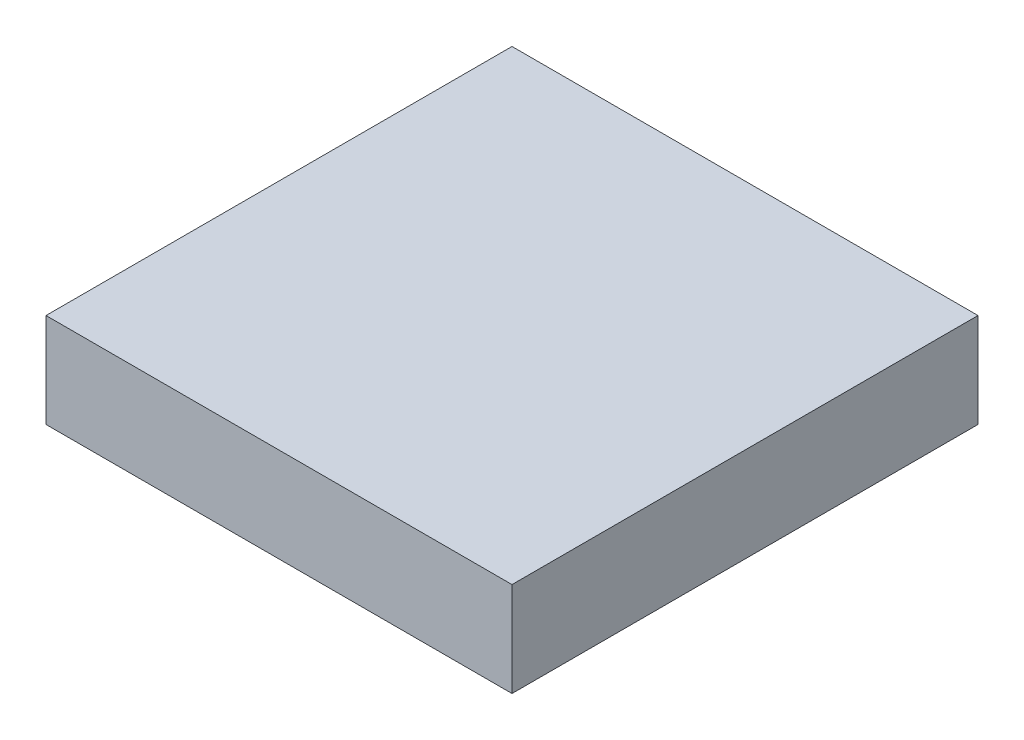
ISO-10303-21;
HEADER;
FILE_DESCRIPTION(('STEP AP214'),'2;1');
FILE_NAME('part.step','',(''),(''),'','','');
FILE_SCHEMA(('AUTOMOTIVE_DESIGN { 1 0 10303 214 1 1 1 1 }'));
ENDSEC;
DATA;
#1=APPLICATION_CONTEXT('core data for automotive mechanical design processes');
#2=APPLICATION_PROTOCOL_DEFINITION('international standard','automotive_design',2000,#1);
#3=PRODUCT_CONTEXT('',#1,'mechanical');
#4=PRODUCT('Part','Part','',(#3));
#5=PRODUCT_RELATED_PRODUCT_CATEGORY('part','',(#4));
#6=PRODUCT_DEFINITION_FORMATION('','',#4);
#7=PRODUCT_DEFINITION_CONTEXT('part definition',#1,'design');
#8=PRODUCT_DEFINITION('design','',#6,#7);
#9=PRODUCT_DEFINITION_SHAPE('','',#8);
#10=(LENGTH_UNIT() NAMED_UNIT(*) SI_UNIT(.MILLI.,.METRE.));
#11=(NAMED_UNIT(*) PLANE_ANGLE_UNIT() SI_UNIT($,.RADIAN.));
#12=(NAMED_UNIT(*) SI_UNIT($,.STERADIAN.) SOLID_ANGLE_UNIT());
#13=UNCERTAINTY_MEASURE_WITH_UNIT(LENGTH_MEASURE(1.E-05),#10,'distance_accuracy_value','');
#14=(GEOMETRIC_REPRESENTATION_CONTEXT(3) GLOBAL_UNCERTAINTY_ASSIGNED_CONTEXT((#13)) GLOBAL_UNIT_ASSIGNED_CONTEXT((#10,
#11,#12)) REPRESENTATION_CONTEXT('',''));
#15=CARTESIAN_POINT('',(0.,0.,0.));
#16=DIRECTION('',(0.,0.,1.));
#17=DIRECTION('',(1.,0.,0.));
#18=AXIS2_PLACEMENT_3D('',#15,#16,#17);
#19=CARTESIAN_POINT('',(-7.9,3.2,-7.9));
#20=DIRECTION('',(1.,0.,0.));
#21=DIRECTION('',(0.,0.,-1.));
#22=AXIS2_PLACEMENT_3D('',#19,#20,#21);
#23=PLANE('',#22);
#24=DIRECTION('',(0.,0.,1.));
#25=VECTOR('',#24,1.);
#26=CARTESIAN_POINT('',(-7.9,0.,-7.9));
#27=LINE('',#26,#25);
#28=CARTESIAN_POINT('',(-7.9,0.,-7.9));
#29=VERTEX_POINT('',#28);
#30=CARTESIAN_POINT('',(-7.9,0.,7.9));
#31=VERTEX_POINT('',#30);
#32=EDGE_CURVE('E166',#29,#31,#27,.T.);
#33=ORIENTED_EDGE('',*,*,#32,.T.);
#34=DIRECTION('',(0.,-1.,0.));
#35=VECTOR('',#34,1.);
#36=CARTESIAN_POINT('',(-7.9,3.2,7.9));
#37=LINE('',#36,#35);
#38=CARTESIAN_POINT('',(-7.9,3.2,7.9));
#39=VERTEX_POINT('',#38);
#40=EDGE_CURVE('E13',#39,#31,#37,.T.);
#41=ORIENTED_EDGE('',*,*,#40,.F.);
#42=DIRECTION('',(0.,0.,1.));
#43=VECTOR('',#42,1.);
#44=CARTESIAN_POINT('',(-7.9,3.2,-7.9));
#45=LINE('',#44,#43);
#46=CARTESIAN_POINT('',(-7.9,3.2,-7.9));
#47=VERTEX_POINT('',#46);
#48=EDGE_CURVE('E159',#47,#39,#45,.T.);
#49=ORIENTED_EDGE('',*,*,#48,.F.);
#50=DIRECTION('',(0.,-1.,0.));
#51=VECTOR('',#50,1.);
#52=CARTESIAN_POINT('',(-7.9,3.2,-7.9));
#53=LINE('',#52,#51);
#54=EDGE_CURVE('E165',#47,#29,#53,.T.);
#55=ORIENTED_EDGE('',*,*,#54,.T.);
#56=EDGE_LOOP('',(#33,#41,#49,#55));
#57=FACE_BOUND('',#56,.T.);
#58=ADVANCED_FACE('F50',(#57),#23,.F.);
#59=CARTESIAN_POINT('',(7.9,3.2,7.9));
#60=DIRECTION('',(0.,0.,-1.));
#61=DIRECTION('',(-1.,0.,0.));
#62=AXIS2_PLACEMENT_3D('',#59,#60,#61);
#63=PLANE('',#62);
#64=DIRECTION('',(1.,0.,0.));
#65=VECTOR('',#64,1.);
#66=CARTESIAN_POINT('',(7.9,0.,7.9));
#67=LINE('',#66,#65);
#68=CARTESIAN_POINT('',(7.9,0.,7.9));
#69=VERTEX_POINT('',#68);
#70=EDGE_CURVE('E169',#31,#69,#67,.T.);
#71=ORIENTED_EDGE('',*,*,#70,.T.);
#72=DIRECTION('',(0.,-1.,0.));
#73=VECTOR('',#72,1.);
#74=CARTESIAN_POINT('',(7.9,3.2,7.9));
#75=LINE('',#74,#73);
#76=CARTESIAN_POINT('',(7.9,3.2,7.9));
#77=VERTEX_POINT('',#76);
#78=EDGE_CURVE('E57',#77,#69,#75,.T.);
#79=ORIENTED_EDGE('',*,*,#78,.F.);
#80=DIRECTION('',(1.,0.,0.));
#81=VECTOR('',#80,1.);
#82=CARTESIAN_POINT('',(7.9,3.2,7.9));
#83=LINE('',#82,#81);
#84=EDGE_CURVE('E101',#39,#77,#83,.T.);
#85=ORIENTED_EDGE('',*,*,#84,.F.);
#86=ORIENTED_EDGE('',*,*,#40,.T.);
#87=EDGE_LOOP('',(#71,#79,#85,#86));
#88=FACE_BOUND('',#87,.T.);
#89=ADVANCED_FACE('F197',(#88),#63,.F.);
#90=CARTESIAN_POINT('',(7.9,3.2,-7.9));
#91=DIRECTION('',(-1.,0.,0.));
#92=DIRECTION('',(0.,0.,1.));
#93=AXIS2_PLACEMENT_3D('',#90,#91,#92);
#94=PLANE('',#93);
#95=DIRECTION('',(0.,0.,-1.));
#96=VECTOR('',#95,1.);
#97=CARTESIAN_POINT('',(7.9,0.,-7.9));
#98=LINE('',#97,#96);
#99=CARTESIAN_POINT('',(7.9,0.,-7.9));
#100=VERTEX_POINT('',#99);
#101=EDGE_CURVE('E171',#69,#100,#98,.T.);
#102=ORIENTED_EDGE('',*,*,#101,.T.);
#103=DIRECTION('',(0.,-1.,0.));
#104=VECTOR('',#103,1.);
#105=CARTESIAN_POINT('',(7.9,3.2,-7.9));
#106=LINE('',#105,#104);
#107=CARTESIAN_POINT('',(7.9,3.2,-7.9));
#108=VERTEX_POINT('',#107);
#109=EDGE_CURVE('E175',#108,#100,#106,.T.);
#110=ORIENTED_EDGE('',*,*,#109,.F.);
#111=DIRECTION('',(0.,0.,-1.));
#112=VECTOR('',#111,1.);
#113=CARTESIAN_POINT('',(7.9,3.2,-7.9));
#114=LINE('',#113,#112);
#115=EDGE_CURVE('E162',#77,#108,#114,.T.);
#116=ORIENTED_EDGE('',*,*,#115,.F.);
#117=ORIENTED_EDGE('',*,*,#78,.T.);
#118=EDGE_LOOP('',(#102,#110,#116,#117));
#119=FACE_BOUND('',#118,.T.);
#120=ADVANCED_FACE('F180',(#119),#94,.F.);
#121=CARTESIAN_POINT('',(7.9,3.2,-7.9));
#122=DIRECTION('',(0.,0.,1.));
#123=DIRECTION('',(1.,0.,0.));
#124=AXIS2_PLACEMENT_3D('',#121,#122,#123);
#125=PLANE('',#124);
#126=DIRECTION('',(-1.,0.,0.));
#127=VECTOR('',#126,1.);
#128=CARTESIAN_POINT('',(7.9,0.,-7.9));
#129=LINE('',#128,#127);
#130=EDGE_CURVE('E94',#100,#29,#129,.T.);
#131=ORIENTED_EDGE('',*,*,#130,.T.);
#132=ORIENTED_EDGE('',*,*,#54,.F.);
#133=DIRECTION('',(-1.,0.,0.));
#134=VECTOR('',#133,1.);
#135=CARTESIAN_POINT('',(7.9,3.2,-7.9));
#136=LINE('',#135,#134);
#137=EDGE_CURVE('E73',#108,#47,#136,.T.);
#138=ORIENTED_EDGE('',*,*,#137,.F.);
#139=ORIENTED_EDGE('',*,*,#109,.T.);
#140=EDGE_LOOP('',(#131,#132,#138,#139));
#141=FACE_BOUND('',#140,.T.);
#142=ADVANCED_FACE('F188',(#141),#125,.F.);
#143=CARTESIAN_POINT('',(0.,3.2,0.));
#144=DIRECTION('',(0.,-1.,0.));
#145=DIRECTION('',(0.,0.,-1.));
#146=AXIS2_PLACEMENT_3D('',#143,#144,#145);
#147=PLANE('',#146);
#148=ORIENTED_EDGE('',*,*,#48,.T.);
#149=ORIENTED_EDGE('',*,*,#84,.T.);
#150=ORIENTED_EDGE('',*,*,#115,.T.);
#151=ORIENTED_EDGE('',*,*,#137,.T.);
#152=EDGE_LOOP('',(#148,#149,#150,#151));
#153=FACE_BOUND('',#152,.T.);
#154=ADVANCED_FACE('F190',(#153),#147,.F.);
#155=CARTESIAN_POINT('',(0.,0.,0.));
#156=DIRECTION('',(0.,-1.,0.));
#157=DIRECTION('',(0.,0.,-1.));
#158=AXIS2_PLACEMENT_3D('',#155,#156,#157);
#159=PLANE('',#158);
#160=DIRECTION('',(-1.,0.,0.));
#161=VECTOR('',#160,1.);
#162=CARTESIAN_POINT('',(0.,0.,6.7));
#163=LINE('',#162,#161);
#164=CARTESIAN_POINT('',(6.7,0.,6.7));
#165=VERTEX_POINT('',#164);
#166=CARTESIAN_POINT('',(-6.7,0.,6.7));
#167=VERTEX_POINT('',#166);
#168=EDGE_CURVE('E64',#165,#167,#163,.T.);
#169=ORIENTED_EDGE('',*,*,#168,.F.);
#170=DIRECTION('',(0.,0.,-1.));
#171=VECTOR('',#170,1.);
#172=CARTESIAN_POINT('',(6.7,0.,0.));
#173=LINE('',#172,#171);
#174=CARTESIAN_POINT('',(6.7,0.,-6.7));
#175=VERTEX_POINT('',#174);
#176=EDGE_CURVE('E144',#165,#175,#173,.T.);
#177=ORIENTED_EDGE('',*,*,#176,.T.);
#178=DIRECTION('',(-1.,0.,0.));
#179=VECTOR('',#178,1.);
#180=CARTESIAN_POINT('',(0.,0.,-6.7));
#181=LINE('',#180,#179);
#182=CARTESIAN_POINT('',(-6.7,0.,-6.7));
#183=VERTEX_POINT('',#182);
#184=EDGE_CURVE('E152',#175,#183,#181,.T.);
#185=ORIENTED_EDGE('',*,*,#184,.T.);
#186=DIRECTION('',(0.,0.,-1.));
#187=VECTOR('',#186,1.);
#188=CARTESIAN_POINT('',(-6.7,0.,0.));
#189=LINE('',#188,#187);
#190=EDGE_CURVE('E132',#167,#183,#189,.T.);
#191=ORIENTED_EDGE('',*,*,#190,.F.);
#192=EDGE_LOOP('',(#169,#177,#185,#191));
#193=FACE_BOUND('',#192,.T.);
#194=ORIENTED_EDGE('',*,*,#32,.F.);
#195=ORIENTED_EDGE('',*,*,#130,.F.);
#196=ORIENTED_EDGE('',*,*,#101,.F.);
#197=ORIENTED_EDGE('',*,*,#70,.F.);
#198=EDGE_LOOP('',(#194,#195,#196,#197));
#199=FACE_BOUND('',#198,.T.);
#200=ADVANCED_FACE('F184',(#193,#199),#159,.T.);
#201=CARTESIAN_POINT('',(0.,22.1504617357995,6.7));
#202=DIRECTION('',(0.,0.,1.));
#203=DIRECTION('',(1.,0.,0.));
#204=AXIS2_PLACEMENT_3D('',#201,#202,#203);
#205=PLANE('',#204);
#206=DIRECTION('',(1.,0.,0.));
#207=VECTOR('',#206,1.);
#208=CARTESIAN_POINT('',(0.,2.,6.7));
#209=LINE('',#208,#207);
#210=CARTESIAN_POINT('',(-6.7,2.,6.7));
#211=VERTEX_POINT('',#210);
#212=CARTESIAN_POINT('',(6.7,2.,6.7));
#213=VERTEX_POINT('',#212);
#214=EDGE_CURVE('E122',#211,#213,#209,.T.);
#215=ORIENTED_EDGE('',*,*,#214,.T.);
#216=DIRECTION('',(0.,-1.,0.));
#217=VECTOR('',#216,1.);
#218=CARTESIAN_POINT('',(6.7,22.1504617357995,6.7));
#219=LINE('',#218,#217);
#220=EDGE_CURVE('E126',#213,#165,#219,.T.);
#221=ORIENTED_EDGE('',*,*,#220,.T.);
#222=ORIENTED_EDGE('',*,*,#168,.T.);
#223=DIRECTION('',(0.,-1.,0.));
#224=VECTOR('',#223,1.);
#225=CARTESIAN_POINT('',(-6.7,22.1504617357995,6.7));
#226=LINE('',#225,#224);
#227=EDGE_CURVE('E128',#211,#167,#226,.T.);
#228=ORIENTED_EDGE('',*,*,#227,.F.);
#229=EDGE_LOOP('',(#215,#221,#222,#228));
#230=FACE_BOUND('',#229,.T.);
#231=ADVANCED_FACE('F124',(#230),#205,.F.);
#232=CARTESIAN_POINT('',(6.7,22.1504617357995,0.));
#233=DIRECTION('',(-1.,0.,0.));
#234=DIRECTION('',(0.,0.,1.));
#235=AXIS2_PLACEMENT_3D('',#232,#233,#234);
#236=PLANE('',#235);
#237=DIRECTION('',(0.,-1.,0.));
#238=VECTOR('',#237,1.);
#239=CARTESIAN_POINT('',(6.7,22.1504617357995,-6.7));
#240=LINE('',#239,#238);
#241=CARTESIAN_POINT('',(6.7,2.,-6.7));
#242=VERTEX_POINT('',#241);
#243=EDGE_CURVE('E150',#242,#175,#240,.T.);
#244=ORIENTED_EDGE('',*,*,#243,.T.);
#245=ORIENTED_EDGE('',*,*,#176,.F.);
#246=ORIENTED_EDGE('',*,*,#220,.F.);
#247=DIRECTION('',(0.,0.,1.));
#248=VECTOR('',#247,1.);
#249=CARTESIAN_POINT('',(6.7,2.,0.));
#250=LINE('',#249,#248);
#251=EDGE_CURVE('E135',#242,#213,#250,.T.);
#252=ORIENTED_EDGE('',*,*,#251,.F.);
#253=EDGE_LOOP('',(#244,#245,#246,#252));
#254=FACE_BOUND('',#253,.T.);
#255=ADVANCED_FACE('F142',(#254),#236,.T.);
#256=CARTESIAN_POINT('',(0.,22.1504617357995,-6.7));
#257=DIRECTION('',(0.,0.,1.));
#258=DIRECTION('',(1.,0.,0.));
#259=AXIS2_PLACEMENT_3D('',#256,#257,#258);
#260=PLANE('',#259);
#261=DIRECTION('',(0.,-1.,0.));
#262=VECTOR('',#261,1.);
#263=CARTESIAN_POINT('',(-6.7,22.1504617357995,-6.7));
#264=LINE('',#263,#262);
#265=CARTESIAN_POINT('',(-6.7,2.,-6.7));
#266=VERTEX_POINT('',#265);
#267=EDGE_CURVE('E153',#266,#183,#264,.T.);
#268=ORIENTED_EDGE('',*,*,#267,.T.);
#269=ORIENTED_EDGE('',*,*,#184,.F.);
#270=ORIENTED_EDGE('',*,*,#243,.F.);
#271=DIRECTION('',(1.,0.,0.));
#272=VECTOR('',#271,1.);
#273=CARTESIAN_POINT('',(0.,2.,-6.7));
#274=LINE('',#273,#272);
#275=EDGE_CURVE('E138',#266,#242,#274,.T.);
#276=ORIENTED_EDGE('',*,*,#275,.F.);
#277=EDGE_LOOP('',(#268,#269,#270,#276));
#278=FACE_BOUND('',#277,.T.);
#279=ADVANCED_FACE('F247',(#278),#260,.T.);
#280=CARTESIAN_POINT('',(0.,22.1504617357995,0.));
#281=DIRECTION('',(0.,-1.,0.));
#282=DIRECTION('',(0.,0.,-1.));
#283=AXIS2_PLACEMENT_3D('',#280,#281,#282);
#284=CYLINDRICAL_SURFACE('',#283,3.3);
#285=CARTESIAN_POINT('',(0.,2.,0.));
#286=DIRECTION('',(0.,-1.,0.));
#287=DIRECTION('',(0.,0.,-1.));
#288=AXIS2_PLACEMENT_3D('',#285,#286,#287);
#289=CIRCLE('',#288,3.3);
#290=CARTESIAN_POINT('',(0.,2.,-3.3));
#291=VERTEX_POINT('',#290);
#292=EDGE_CURVE('E324',#291,#291,#289,.F.);
#293=ORIENTED_EDGE('',*,*,#292,.F.);
#294=EDGE_LOOP('',(#293));
#295=FACE_BOUND('',#294,.T.);
#296=CARTESIAN_POINT('',(0.,0.,0.));
#297=DIRECTION('',(0.,-1.,0.));
#298=DIRECTION('',(0.,0.,-1.));
#299=AXIS2_PLACEMENT_3D('',#296,#297,#298);
#300=CIRCLE('',#299,3.3);
#301=CARTESIAN_POINT('',(0.,0.,-3.3));
#302=VERTEX_POINT('',#301);
#303=EDGE_CURVE('E155',#302,#302,#300,.T.);
#304=ORIENTED_EDGE('',*,*,#303,.F.);
#305=EDGE_LOOP('',(#304));
#306=FACE_BOUND('',#305,.T.);
#307=ADVANCED_FACE('F256',(#295,#306),#284,.T.);
#308=CARTESIAN_POINT('',(-6.7,22.1504617357995,0.));
#309=DIRECTION('',(-1.,0.,0.));
#310=DIRECTION('',(0.,0.,1.));
#311=AXIS2_PLACEMENT_3D('',#308,#309,#310);
#312=PLANE('',#311);
#313=DIRECTION('',(0.,0.,1.));
#314=VECTOR('',#313,1.);
#315=CARTESIAN_POINT('',(-6.7,2.,0.));
#316=LINE('',#315,#314);
#317=EDGE_CURVE('E131',#266,#211,#316,.T.);
#318=ORIENTED_EDGE('',*,*,#317,.T.);
#319=ORIENTED_EDGE('',*,*,#227,.T.);
#320=ORIENTED_EDGE('',*,*,#190,.T.);
#321=ORIENTED_EDGE('',*,*,#267,.F.);
#322=EDGE_LOOP('',(#318,#319,#320,#321));
#323=FACE_BOUND('',#322,.T.);
#324=ADVANCED_FACE('F266',(#323),#312,.F.);
#325=CARTESIAN_POINT('',(0.,2.,0.));
#326=DIRECTION('',(0.,-1.,0.));
#327=DIRECTION('',(0.,0.,-1.));
#328=AXIS2_PLACEMENT_3D('',#325,#326,#327);
#329=PLANE('',#328);
#330=ORIENTED_EDGE('',*,*,#214,.F.);
#331=ORIENTED_EDGE('',*,*,#317,.F.);
#332=ORIENTED_EDGE('',*,*,#275,.T.);
#333=ORIENTED_EDGE('',*,*,#251,.T.);
#334=EDGE_LOOP('',(#330,#331,#332,#333));
#335=FACE_BOUND('',#334,.T.);
#336=ORIENTED_EDGE('',*,*,#292,.T.);
#337=EDGE_LOOP('',(#336));
#338=FACE_BOUND('',#337,.T.);
#339=ADVANCED_FACE('F136',(#335,#338),#329,.T.);
#340=CARTESIAN_POINT('',(0.,0.,0.));
#341=DIRECTION('',(0.,-1.,0.));
#342=DIRECTION('',(0.,0.,-1.));
#343=AXIS2_PLACEMENT_3D('',#340,#341,#342);
#344=CIRCLE('',#343,2.5);
#345=CARTESIAN_POINT('',(0.,0.,-2.5));
#346=VERTEX_POINT('',#345);
#347=EDGE_CURVE('E317',#346,#346,#344,.T.);
#348=ORIENTED_EDGE('',*,*,#347,.F.);
#349=EDGE_LOOP('',(#348));
#350=FACE_BOUND('',#349,.T.);
#351=ORIENTED_EDGE('',*,*,#303,.T.);
#352=EDGE_LOOP('',(#351));
#353=FACE_BOUND('',#352,.T.);
#354=ADVANCED_FACE('F230',(#350,#353),#159,.T.);
#355=CARTESIAN_POINT('',(0.,22.1504617357995,0.));
#356=DIRECTION('',(0.,-1.,0.));
#357=DIRECTION('',(0.,0.,-1.));
#358=AXIS2_PLACEMENT_3D('',#355,#356,#357);
#359=CYLINDRICAL_SURFACE('',#358,2.5);
#360=CARTESIAN_POINT('',(0.,2.,0.));
#361=DIRECTION('',(0.,-1.,0.));
#362=DIRECTION('',(0.,0.,-1.));
#363=AXIS2_PLACEMENT_3D('',#360,#361,#362);
#364=CIRCLE('',#363,2.5);
#365=CARTESIAN_POINT('',(0.,2.,-2.5));
#366=VERTEX_POINT('',#365);
#367=EDGE_CURVE('E156',#366,#366,#364,.F.);
#368=ORIENTED_EDGE('',*,*,#367,.T.);
#369=EDGE_LOOP('',(#368));
#370=FACE_BOUND('',#369,.T.);
#371=ORIENTED_EDGE('',*,*,#347,.T.);
#372=EDGE_LOOP('',(#371));
#373=FACE_BOUND('',#372,.T.);
#374=ADVANCED_FACE('F293',(#370,#373),#359,.F.);
#375=CARTESIAN_POINT('',(0.,2.,0.));
#376=DIRECTION('',(0.,-1.,0.));
#377=DIRECTION('',(0.,0.,-1.));
#378=AXIS2_PLACEMENT_3D('',#375,#376,#377);
#379=PLANE('',#378);
#380=ORIENTED_EDGE('',*,*,#367,.F.);
#381=EDGE_LOOP('',(#380));
#382=FACE_BOUND('',#381,.T.);
#383=ADVANCED_FACE('F301',(#382),#379,.T.);
#384=CLOSED_SHELL('',(#58,#89,#120,#142,#154,#200,#231,#255,#279,#307,#324,#339,#354,#374,#383));
#385=MANIFOLD_SOLID_BREP('B2',#384);
#386=ADVANCED_BREP_SHAPE_REPRESENTATION('',(#18,#385),#14);
#387=SHAPE_DEFINITION_REPRESENTATION(#9,#386);
ENDSEC;
END-ISO-10303-21;
